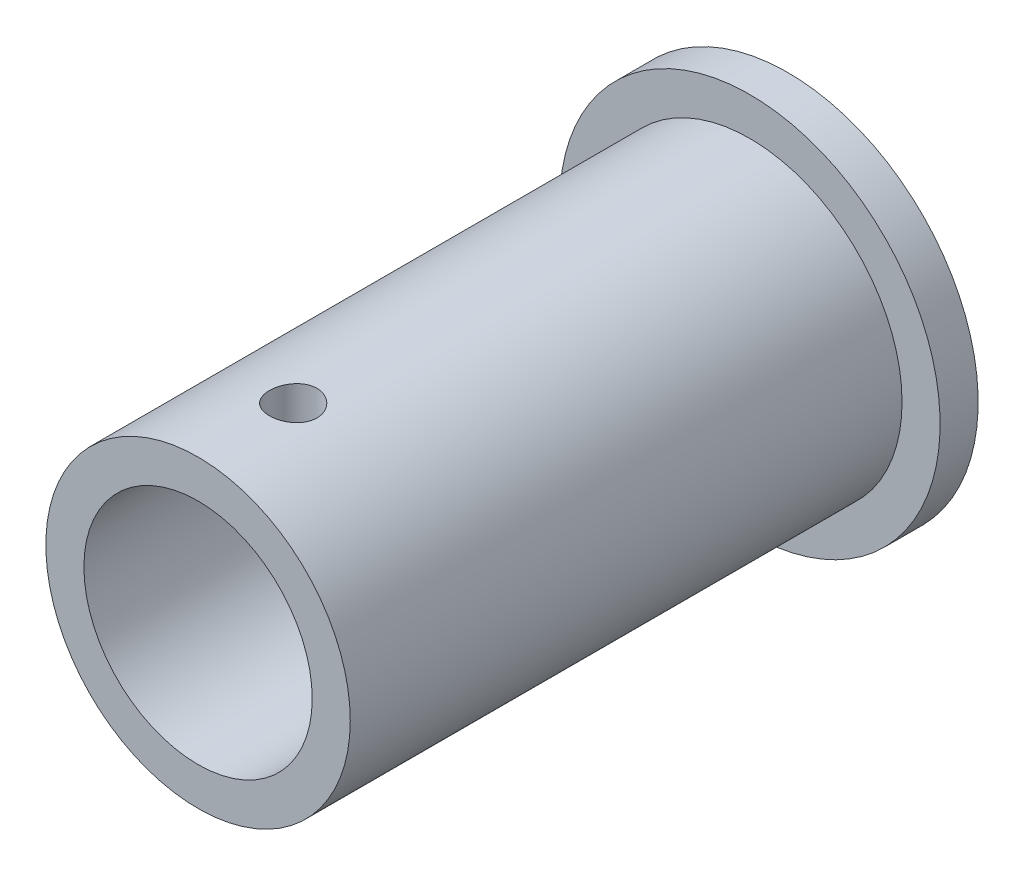
ISO-10303-21;
HEADER;
FILE_DESCRIPTION(('STEP AP214'),'2;1');
FILE_NAME('part.step','',(''),(''),'','','');
FILE_SCHEMA(('AUTOMOTIVE_DESIGN { 1 0 10303 214 1 1 1 1 }'));
ENDSEC;
DATA;
#1=APPLICATION_CONTEXT('core data for automotive mechanical design processes');
#2=APPLICATION_PROTOCOL_DEFINITION('international standard','automotive_design',2000,#1);
#3=PRODUCT_CONTEXT('',#1,'mechanical');
#4=PRODUCT('Part','Part','',(#3));
#5=PRODUCT_RELATED_PRODUCT_CATEGORY('part','',(#4));
#6=PRODUCT_DEFINITION_FORMATION('','',#4);
#7=PRODUCT_DEFINITION_CONTEXT('part definition',#1,'design');
#8=PRODUCT_DEFINITION('design','',#6,#7);
#9=PRODUCT_DEFINITION_SHAPE('','',#8);
#10=(LENGTH_UNIT() NAMED_UNIT(*) SI_UNIT(.MILLI.,.METRE.));
#11=(NAMED_UNIT(*) PLANE_ANGLE_UNIT() SI_UNIT($,.RADIAN.));
#12=(NAMED_UNIT(*) SI_UNIT($,.STERADIAN.) SOLID_ANGLE_UNIT());
#13=UNCERTAINTY_MEASURE_WITH_UNIT(LENGTH_MEASURE(1.E-05),#10,'distance_accuracy_value','');
#14=(GEOMETRIC_REPRESENTATION_CONTEXT(3) GLOBAL_UNCERTAINTY_ASSIGNED_CONTEXT((#13)) GLOBAL_UNIT_ASSIGNED_CONTEXT((#10,
#11,#12)) REPRESENTATION_CONTEXT('',''));
#15=CARTESIAN_POINT('',(0.,0.,0.));
#16=DIRECTION('',(0.,0.,1.));
#17=DIRECTION('',(1.,0.,0.));
#18=AXIS2_PLACEMENT_3D('',#15,#16,#17);
#19=CARTESIAN_POINT('',(0.,0.,-2.));
#20=DIRECTION('',(0.,0.,-1.));
#21=DIRECTION('',(-1.,0.,0.));
#22=AXIS2_PLACEMENT_3D('',#19,#20,#21);
#23=PLANE('',#22);
#24=CARTESIAN_POINT('',(0.,0.,-2.));
#25=DIRECTION('',(0.,0.,-1.));
#26=DIRECTION('',(-1.,0.,0.));
#27=AXIS2_PLACEMENT_3D('',#24,#25,#26);
#28=CIRCLE('',#27,10.);
#29=CARTESIAN_POINT('',(-10.,0.,-2.));
#30=VERTEX_POINT('',#29);
#31=EDGE_CURVE('E11',#30,#30,#28,.T.);
#32=ORIENTED_EDGE('',*,*,#31,.T.);
#33=EDGE_LOOP('',(#32));
#34=FACE_BOUND('',#33,.T.);
#35=CARTESIAN_POINT('',(0.,0.,-2.));
#36=DIRECTION('',(0.,0.,-1.));
#37=DIRECTION('',(-1.,0.,0.));
#38=AXIS2_PLACEMENT_3D('',#35,#36,#37);
#39=CIRCLE('',#38,6.);
#40=CARTESIAN_POINT('',(-6.,0.,-2.));
#41=VERTEX_POINT('',#40);
#42=EDGE_CURVE('E55',#41,#41,#39,.T.);
#43=ORIENTED_EDGE('',*,*,#42,.F.);
#44=EDGE_LOOP('',(#43));
#45=FACE_BOUND('',#44,.T.);
#46=ADVANCED_FACE('F44',(#34,#45),#23,.T.);
#47=CARTESIAN_POINT('',(0.,0.,0.));
#48=DIRECTION('',(0.,0.,-1.));
#49=DIRECTION('',(-1.,0.,0.));
#50=AXIS2_PLACEMENT_3D('',#47,#48,#49);
#51=PLANE('',#50);
#52=CARTESIAN_POINT('',(0.,0.,0.));
#53=DIRECTION('',(0.,0.,-1.));
#54=DIRECTION('',(-1.,0.,0.));
#55=AXIS2_PLACEMENT_3D('',#52,#53,#54);
#56=CIRCLE('',#55,10.);
#57=CARTESIAN_POINT('',(-10.,0.,0.));
#58=VERTEX_POINT('',#57);
#59=EDGE_CURVE('E48',#58,#58,#56,.T.);
#60=ORIENTED_EDGE('',*,*,#59,.F.);
#61=EDGE_LOOP('',(#60));
#62=FACE_BOUND('',#61,.T.);
#63=CARTESIAN_POINT('',(0.,0.,0.));
#64=DIRECTION('',(0.,0.,-1.));
#65=DIRECTION('',(-1.,0.,0.));
#66=AXIS2_PLACEMENT_3D('',#63,#64,#65);
#67=CIRCLE('',#66,6.);
#68=CARTESIAN_POINT('',(-6.,0.,0.));
#69=VERTEX_POINT('',#68);
#70=EDGE_CURVE('E57',#69,#69,#67,.T.);
#71=ORIENTED_EDGE('',*,*,#70,.T.);
#72=EDGE_LOOP('',(#71));
#73=FACE_BOUND('',#72,.T.);
#74=ADVANCED_FACE('F67',(#62,#73),#51,.F.);
#75=CARTESIAN_POINT('',(0.,0.,-2.));
#76=DIRECTION('',(0.,0.,1.));
#77=DIRECTION('',(1.,0.,0.));
#78=AXIS2_PLACEMENT_3D('',#75,#76,#77);
#79=CYLINDRICAL_SURFACE('',#78,10.);
#80=ORIENTED_EDGE('',*,*,#31,.F.);
#81=EDGE_LOOP('',(#80));
#82=FACE_BOUND('',#81,.T.);
#83=ORIENTED_EDGE('',*,*,#59,.T.);
#84=EDGE_LOOP('',(#83));
#85=FACE_BOUND('',#84,.T.);
#86=ADVANCED_FACE('F46',(#82,#85),#79,.T.);
#87=CARTESIAN_POINT('',(0.,0.,-2.));
#88=DIRECTION('',(0.,0.,1.));
#89=DIRECTION('',(1.,0.,0.));
#90=AXIS2_PLACEMENT_3D('',#87,#88,#89);
#91=CYLINDRICAL_SURFACE('',#90,6.);
#92=ORIENTED_EDGE('',*,*,#42,.T.);
#93=EDGE_LOOP('',(#92));
#94=FACE_BOUND('',#93,.T.);
#95=ORIENTED_EDGE('',*,*,#70,.F.);
#96=EDGE_LOOP('',(#95));
#97=FACE_BOUND('',#96,.T.);
#98=ADVANCED_FACE('F63',(#94,#97),#91,.F.);
#99=CLOSED_SHELL('',(#46,#74,#86,#98));
#100=MANIFOLD_SOLID_BREP('B2',#99);
#101=CARTESIAN_POINT('',(0.,0.,29.));
#102=DIRECTION('',(0.,0.,-1.));
#103=DIRECTION('',(-1.,0.,0.));
#104=AXIS2_PLACEMENT_3D('',#101,#102,#103);
#105=CYLINDRICAL_SURFACE('',#104,8.);
#106=CARTESIAN_POINT('',(0.,0.,29.));
#107=DIRECTION('',(0.,0.,1.));
#108=DIRECTION('',(1.,0.,0.));
#109=AXIS2_PLACEMENT_3D('',#106,#107,#108);
#110=CIRCLE('',#109,8.);
#111=CARTESIAN_POINT('',(8.,0.,29.));
#112=VERTEX_POINT('',#111);
#113=EDGE_CURVE('E43',#112,#112,#110,.T.);
#114=ORIENTED_EDGE('',*,*,#113,.F.);
#115=EDGE_LOOP('',(#114));
#116=FACE_BOUND('',#115,.T.);
#117=CARTESIAN_POINT('',(0.,0.,0.));
#118=DIRECTION('',(0.,0.,1.));
#119=DIRECTION('',(1.,0.,0.));
#120=AXIS2_PLACEMENT_3D('',#117,#118,#119);
#121=CIRCLE('',#120,8.);
#122=CARTESIAN_POINT('',(8.,0.,0.));
#123=VERTEX_POINT('',#122);
#124=EDGE_CURVE('E119',#123,#123,#121,.T.);
#125=ORIENTED_EDGE('',*,*,#124,.T.);
#126=EDGE_LOOP('',(#125));
#127=FACE_BOUND('',#126,.T.);
#128=CARTESIAN_POINT('',(0.,8.,22.75));
#129=CARTESIAN_POINT('',(-0.0697575486355165,7.99999885097242,22.7500028491358));
#130=CARTESIAN_POINT('',(-0.139554702432852,7.9990780624287,22.7558590568868));
#131=CARTESIAN_POINT('',(-0.277195657489051,7.99549349048796,22.7791218456384));
#132=CARTESIAN_POINT('',(-0.345037530661658,7.99282804422361,22.7965394462518));
#133=CARTESIAN_POINT('',(-0.476756269023701,7.98605348582888,22.8423898314033));
#134=CARTESIAN_POINT('',(-0.540636176144951,7.98194549781586,22.8708140406808));
#135=CARTESIAN_POINT('',(-0.662710625522299,7.97273897019077,22.9378492725708));
#136=CARTESIAN_POINT('',(-0.720905905184154,7.96764055931276,22.976458971518));
#137=CARTESIAN_POINT('',(-0.83045995582581,7.95697134207178,23.063116524177));
#138=CARTESIAN_POINT('',(-0.881763739571324,7.95139725696168,23.1112334974451));
#139=CARTESIAN_POINT('',(-0.975603844114118,7.94043038065143,23.2153909741344));
#140=CARTESIAN_POINT('',(-1.01813964327096,7.93503760025374,23.2714319486501));
#141=CARTESIAN_POINT('',(-1.09345272164442,7.92501214063722,23.3902191356719));
#142=CARTESIAN_POINT('',(-1.12617636778996,7.92038369893052,23.4529997411809));
#143=CARTESIAN_POINT('',(-1.18059340798533,7.91245600871182,23.5832507054289));
#144=CARTESIAN_POINT('',(-1.20228745505032,7.90915668151108,23.6507207862553));
#145=CARTESIAN_POINT('',(-1.23385779661084,7.90429317255518,23.7878554505719));
#146=CARTESIAN_POINT('',(-1.24382852743748,7.90271513266182,23.8574977929094));
#147=CARTESIAN_POINT('',(-1.25196184878811,7.90143085535887,23.9974835944463));
#148=CARTESIAN_POINT('',(-1.25012517430233,7.90172450144011,24.067827009733));
#149=CARTESIAN_POINT('',(-1.23477290404445,7.90413775227603,24.2065485159263));
#150=CARTESIAN_POINT('',(-1.22136281479847,7.90624086092473,24.2749386116766));
#151=CARTESIAN_POINT('',(-1.18340968916876,7.91201028172736,24.4084860031797));
#152=CARTESIAN_POINT('',(-1.15886631342066,7.91567664153206,24.4736432003203));
#153=CARTESIAN_POINT('',(-1.09923458474692,7.92417753427311,24.5991943563386));
#154=CARTESIAN_POINT('',(-1.06410186157775,7.92901696543622,24.6595668958865));
#155=CARTESIAN_POINT('',(-0.984320290733188,7.93931523075049,24.7735997678428));
#156=CARTESIAN_POINT('',(-0.939670766265085,7.94477410894106,24.8272596224437));
#157=CARTESIAN_POINT('',(-0.841545444111666,7.95576893124448,24.9269551233167));
#158=CARTESIAN_POINT('',(-0.787979002802697,7.96130506817796,24.9729015791347));
#159=CARTESIAN_POINT('',(-0.673848473689682,7.97177562673913,25.0551665728199));
#160=CARTESIAN_POINT('',(-0.613284350340662,7.97671004531012,25.0914850617784));
#161=CARTESIAN_POINT('',(-0.486797963528248,7.98542699513518,25.1534690367112));
#162=CARTESIAN_POINT('',(-0.420872093120232,7.98920874270967,25.1791272792665));
#163=CARTESIAN_POINT('',(-0.285574767348381,7.99518780000339,25.2189829837236));
#164=CARTESIAN_POINT('',(-0.216203565343601,7.99738522604488,25.2331812870332));
#165=CARTESIAN_POINT('',(-0.076754168381868,7.99993255863639,25.2495946382251));
#166=CARTESIAN_POINT('',(-0.0066907307543512,8.0003013589643,25.2519322394881));
#167=CARTESIAN_POINT('',(0.132827273205821,7.99920143245634,25.244883647332));
#168=CARTESIAN_POINT('',(0.202281859962578,7.99773276749822,25.2354978487054));
#169=CARTESIAN_POINT('',(0.338236723132853,7.99313461846611,25.2053708061599));
#170=CARTESIAN_POINT('',(0.404750631028022,7.99001392107693,25.1846896208661));
#171=CARTESIAN_POINT('',(0.533367033928314,7.98246037841779,25.1326224528006));
#172=CARTESIAN_POINT('',(0.595469306519704,7.97802746705036,25.1012359307787));
#173=CARTESIAN_POINT('',(0.714036101125203,7.96829486370472,25.0283640044367));
#174=CARTESIAN_POINT('',(0.770452561891861,7.9629886433171,24.9868012899548));
#175=CARTESIAN_POINT('',(0.87555348253903,7.95211940232218,24.8948639570461));
#176=CARTESIAN_POINT('',(0.924237452235089,7.94655636546338,24.8444887803976));
#177=CARTESIAN_POINT('',(1.01294040388345,7.93574013768325,24.7358094013914));
#178=CARTESIAN_POINT('',(1.05287699292063,7.93049020595401,24.6774375764388));
#179=CARTESIAN_POINT('',(1.1223778386332,7.92095346402914,24.5547419631693));
#180=CARTESIAN_POINT('',(1.15194239389052,7.91666662610998,24.4904183462553));
#181=CARTESIAN_POINT('',(1.19973385972497,7.90956535676178,24.3578851796429));
#182=CARTESIAN_POINT('',(1.21800327473956,7.9067454117448,24.2896912656172));
#183=CARTESIAN_POINT('',(1.24282061020268,7.90288285140397,24.151155428168));
#184=CARTESIAN_POINT('',(1.24936941542499,7.9018401019222,24.0808136672905));
#185=CARTESIAN_POINT('',(1.25053726345378,7.90165529022442,23.9408006420463));
#186=CARTESIAN_POINT('',(1.24528590274213,7.90249258021451,23.8711304515333));
#187=CARTESIAN_POINT('',(1.2232811162795,7.90592849470915,23.7336773514279));
#188=CARTESIAN_POINT('',(1.20652771543481,7.90852711539975,23.6658944377491));
#189=CARTESIAN_POINT('',(1.16204164945926,7.91518544427452,23.5341810866797));
#190=CARTESIAN_POINT('',(1.1343188086929,7.91924384476704,23.4702472608708));
#191=CARTESIAN_POINT('',(1.06869384273209,7.92836592023698,23.3479171931619));
#192=CARTESIAN_POINT('',(1.03079131410443,7.93342963505413,23.2895211708558));
#193=CARTESIAN_POINT('',(0.9454150406954,7.9440578404613,23.1792672279366));
#194=CARTESIAN_POINT('',(0.897845535473845,7.94962700580145,23.1274839016931));
#195=CARTESIAN_POINT('',(0.794687973191023,7.96060021820367,23.0325893818066));
#196=CARTESIAN_POINT('',(0.739098060392164,7.96600422670061,22.9894802007041));
#197=CARTESIAN_POINT('',(0.621083429421708,7.9760755122835,22.9129243884842));
#198=CARTESIAN_POINT('',(0.558619686071192,7.98073817215134,22.8795373136202));
#199=CARTESIAN_POINT('',(0.428925941178892,7.9887562991944,22.8237795019035));
#200=CARTESIAN_POINT('',(0.361700888290881,7.9921131007106,22.8013975137208));
#201=CARTESIAN_POINT('',(0.245157119955797,7.9963872293244,22.7732834894547));
#202=CARTESIAN_POINT('',(0.196552787825812,7.99773495813061,22.7645657546855));
#203=CARTESIAN_POINT('',(0.0986388989252913,7.99954174348811,22.7529230433105));
#204=CARTESIAN_POINT('',(0.0493293520845594,8.00000081253982,22.7499979852213));
#205=CARTESIAN_POINT('',(0.,8.,22.75));
#206=B_SPLINE_CURVE_WITH_KNOTS('',3,(#128,#129,#130,#131,#132,#133,#134,#135,#136,#137,#138,
#139,#140,#141,#142,#143,#144,#145,#146,#147,#148,#149,#150,#151,#152,#153,#154,#155,#156,#157,
#158,#159,#160,#161,#162,#163,#164,#165,#166,#167,#168,#169,#170,#171,#172,#173,#174,#175,#176,
#177,#178,#179,#180,#181,#182,#183,#184,#185,#186,#187,#188,#189,#190,#191,#192,#193,#194,#195,
#196,#197,#198,#199,#200,#201,#202,#203,#204,#205),.UNSPECIFIED.,.T.,.F.,(4,2,2,2,2,2,2,2,2,2,2,
2,2,2,2,2,2,2,2,2,2,2,2,2,2,2,2,2,2,2,2,2,2,2,2,2,2,2,4),(0.,0.209092370238746,
0.418384321264007,0.627513539720512,0.83661559396015,1.047297840761,1.25799261822711,
1.4698188930288,1.68163262504619,1.89172815567497,2.10181060835273,2.3099978801129,
2.51819149825525,2.72726988701174,2.93636314946034,3.14772866167183,3.35909524756913,
3.57060521877282,3.78209965914933,3.99140427002957,4.20070183264178,4.40889722378284,
4.61710310371016,4.82694270734836,5.03679560800708,5.24854740124796,5.46029309824491,
5.67123705197566,5.88216508114649,6.09078790799346,6.29941028309449,6.5078462348331,
6.71629044835674,6.92691006157771,7.1375784857115,7.34951152099922,7.56122742828141,
7.7090900817577,7.85695065529355),.UNSPECIFIED.);
#207=CARTESIAN_POINT('',(0.,8.,22.75));
#208=VERTEX_POINT('',#207);
#209=EDGE_CURVE('E131',#208,#208,#206,.T.);
#210=ORIENTED_EDGE('',*,*,#209,.F.);
#211=EDGE_LOOP('',(#210));
#212=FACE_BOUND('',#211,.T.);
#213=ADVANCED_FACE('F105',(#116,#127,#212),#105,.T.);
#214=CARTESIAN_POINT('',(0.,0.,29.));
#215=DIRECTION('',(0.,0.,-1.));
#216=DIRECTION('',(-1.,0.,0.));
#217=AXIS2_PLACEMENT_3D('',#214,#215,#216);
#218=CYLINDRICAL_SURFACE('',#217,6.);
#219=CARTESIAN_POINT('',(0.,0.,0.));
#220=DIRECTION('',(0.,0.,1.));
#221=DIRECTION('',(1.,0.,0.));
#222=AXIS2_PLACEMENT_3D('',#219,#220,#221);
#223=CIRCLE('',#222,6.);
#224=CARTESIAN_POINT('',(6.,0.,0.));
#225=VERTEX_POINT('',#224);
#226=EDGE_CURVE('E127',#225,#225,#223,.T.);
#227=ORIENTED_EDGE('',*,*,#226,.F.);
#228=EDGE_LOOP('',(#227));
#229=FACE_BOUND('',#228,.T.);
#230=CARTESIAN_POINT('',(0.,0.,29.));
#231=DIRECTION('',(0.,0.,1.));
#232=DIRECTION('',(1.,0.,0.));
#233=AXIS2_PLACEMENT_3D('',#230,#231,#232);
#234=CIRCLE('',#233,6.);
#235=CARTESIAN_POINT('',(6.,0.,29.));
#236=VERTEX_POINT('',#235);
#237=EDGE_CURVE('E125',#236,#236,#234,.T.);
#238=ORIENTED_EDGE('',*,*,#237,.T.);
#239=EDGE_LOOP('',(#238));
#240=FACE_BOUND('',#239,.T.);
#241=CARTESIAN_POINT('',(0.,6.,22.75));
#242=CARTESIAN_POINT('',(-0.0694090417016606,5.99999871526651,22.7500024774692));
#243=CARTESIAN_POINT('',(-0.138848789520875,5.99878328775043,22.7558006657188));
#244=CARTESIAN_POINT('',(-0.275761316266993,5.9940520099068,22.7788193495328));
#245=CARTESIAN_POINT('',(-0.343232560128313,5.99053441189248,22.7960485230369));
#246=CARTESIAN_POINT('',(-0.474209132291342,5.98159109196202,22.8413704549218));
#247=CARTESIAN_POINT('',(-0.537718336709184,5.97616727052645,22.8694523959989));
#248=CARTESIAN_POINT('',(-0.659120328605958,5.96399927809859,22.9356496088562));
#249=CARTESIAN_POINT('',(-0.717013367534327,5.95725516625975,22.9737644311558));
#250=CARTESIAN_POINT('',(-0.826390324308837,5.9430770002465,23.0595363401906));
#251=CARTESIAN_POINT('',(-0.877780244162686,5.93563505848531,23.1073120012351));
#252=CARTESIAN_POINT('',(-0.971877776769394,5.92095657692448,23.2107946591951));
#253=CARTESIAN_POINT('',(-1.01458467096099,5.91372005416683,23.2665023118723));
#254=CARTESIAN_POINT('',(-1.09051031677217,5.90019442595308,23.3849519687662));
#255=CARTESIAN_POINT('',(-1.12363054680651,5.89391545174828,23.4477583845027));
#256=CARTESIAN_POINT('',(-1.17881119348064,5.8831284065002,23.5781974517728));
#257=CARTESIAN_POINT('',(-1.20087280167641,5.87862014467568,23.6458295824425));
#258=CARTESIAN_POINT('',(-1.23300240133737,5.87196500986123,23.7829852374156));
#259=CARTESIAN_POINT('',(-1.24323597696799,5.86978556855865,23.8524683593348));
#260=CARTESIAN_POINT('',(-1.25193357655615,5.86793690716491,23.9921968428626));
#261=CARTESIAN_POINT('',(-1.25039890894687,5.86826740800981,24.0624421188653));
#262=CARTESIAN_POINT('',(-1.23573719037197,5.87137174319175,24.2004810279752));
#263=CARTESIAN_POINT('',(-1.2228010523272,5.87410533679901,24.2682959796612));
#264=CARTESIAN_POINT('',(-1.18600543529945,5.88164437615942,24.4007715096449));
#265=CARTESIAN_POINT('',(-1.16214539481382,5.88644992841317,24.4654319256063));
#266=CARTESIAN_POINT('',(-1.10400003213928,5.89763191464102,24.590307228416));
#267=CARTESIAN_POINT('',(-1.06964002534237,5.90401953785586,24.6504862965271));
#268=CARTESIAN_POINT('',(-0.991522699274819,5.91763890010721,24.7642957442682));
#269=CARTESIAN_POINT('',(-0.94776421226259,5.92487074398537,24.817925308836));
#270=CARTESIAN_POINT('',(-0.851074921546786,5.93953730929909,24.9182139610804));
#271=CARTESIAN_POINT('',(-0.797981433412084,5.94697323199473,24.964716168897));
#272=CARTESIAN_POINT('',(-0.684667288611799,5.96108088143001,25.048180442229));
#273=CARTESIAN_POINT('',(-0.624446525025767,5.96775259670236,25.0851423645984));
#274=CARTESIAN_POINT('',(-0.49840554123548,5.97959870942815,25.148510081536));
#275=CARTESIAN_POINT('',(-0.432575461926501,5.98477039710258,25.1748968045671));
#276=CARTESIAN_POINT('',(-0.297284620972155,5.99301338211281,25.2161917048355));
#277=CARTESIAN_POINT('',(-0.22782433859509,5.99608495596053,25.2311013932314));
#278=CARTESIAN_POINT('',(-0.088591865700835,5.99974275215456,25.2487942520679));
#279=CARTESIAN_POINT('',(-0.0188480555261786,6.00037293537579,25.2517919414943));
#280=CARTESIAN_POINT('',(0.120143798757714,5.99919952252774,25.2461550500309));
#281=CARTESIAN_POINT('',(0.189391872962257,5.99739607548153,25.2375211813984));
#282=CARTESIAN_POINT('',(0.324726367119813,5.99158564979184,25.2090443465305));
#283=CARTESIAN_POINT('',(0.390837192894206,5.98760052868077,25.1893125146165));
#284=CARTESIAN_POINT('',(0.518811446661332,5.97787227242395,25.1393221395786));
#285=CARTESIAN_POINT('',(0.580674536336775,5.97212899744579,25.109062759134));
#286=CARTESIAN_POINT('',(0.699294306943494,5.95941241490714,25.0384196217624));
#287=CARTESIAN_POINT('',(0.755973219469834,5.9524239381233,24.9979080704309));
#288=CARTESIAN_POINT('',(0.86180544588652,5.93802568299709,24.9080804369237));
#289=CARTESIAN_POINT('',(0.910957877913286,5.93061585542511,24.8587633244811));
#290=CARTESIAN_POINT('',(1.0011786486518,5.91606024531377,24.7517444230003));
#291=CARTESIAN_POINT('',(1.04209914600204,5.90892089307501,24.6939169680447));
#292=CARTESIAN_POINT('',(1.11364719079243,5.89585601015805,24.5720837157862));
#293=CARTESIAN_POINT('',(1.14427516677864,5.88993042894651,24.5080781758609));
#294=CARTESIAN_POINT('',(1.19417246443922,5.88001700708041,24.3760388037018));
#295=CARTESIAN_POINT('',(1.21350309828032,5.87601872784687,24.3080289628342));
#296=CARTESIAN_POINT('',(1.24044038523407,5.87039184709697,24.1696334495077));
#297=CARTESIAN_POINT('',(1.24804871544441,5.86876290660367,24.0992481183806));
#298=CARTESIAN_POINT('',(1.25125926487611,5.86807907308506,23.9595865990004));
#299=CARTESIAN_POINT('',(1.24709542622726,5.86897402321502,23.8903159297779));
#300=CARTESIAN_POINT('',(1.22739905314032,5.87312447254927,23.7534859910798));
#301=CARTESIAN_POINT('',(1.21186662782266,5.87637994909626,23.6859267051839));
#302=CARTESIAN_POINT('',(1.16998217768585,5.88486132447716,23.5546022281093));
#303=CARTESIAN_POINT('',(1.14366117568421,5.8900815700793,23.4908267535131));
#304=CARTESIAN_POINT('',(1.08097457299757,5.90190705738738,23.3685612239733));
#305=CARTESIAN_POINT('',(1.0446080398303,5.9085124276546,23.3100716603669));
#306=CARTESIAN_POINT('',(0.962073695342413,5.92251579551146,23.1988783729206));
#307=CARTESIAN_POINT('',(0.915737890418228,5.92992613868404,23.146300875435));
#308=CARTESIAN_POINT('',(0.814924438115336,5.94461839583213,23.0495905067736));
#309=CARTESIAN_POINT('',(0.76044491883297,5.9519002798488,23.0054595824485));
#310=CARTESIAN_POINT('',(0.644134427507706,5.96561444547638,22.9264114268159));
#311=CARTESIAN_POINT('',(0.582225921521351,5.97203596073244,22.8916063201137));
#312=CARTESIAN_POINT('',(0.453319843998456,5.98319908494092,22.83294977157));
#313=CARTESIAN_POINT('',(0.386326781907246,5.98794216182101,22.8090887528181));
#314=CARTESIAN_POINT('',(0.266015292900107,5.99432499781444,22.7774597217116));
#315=CARTESIAN_POINT('',(0.213367593727931,5.99644035661395,22.7671812367911));
#316=CARTESIAN_POINT('',(0.107152674176538,5.99927832789758,22.7534505457227));
#317=CARTESIAN_POINT('',(0.0535854878488722,6.00000099184586,22.7499980873328));
#318=CARTESIAN_POINT('',(0.,6.,22.75));
#319=B_SPLINE_CURVE_WITH_KNOTS('',3,(#241,#242,#243,#244,#245,#246,#247,#248,#249,#250,#251,
#252,#253,#254,#255,#256,#257,#258,#259,#260,#261,#262,#263,#264,#265,#266,#267,#268,#269,#270,
#271,#272,#273,#274,#275,#276,#277,#278,#279,#280,#281,#282,#283,#284,#285,#286,#287,#288,#289,
#290,#291,#292,#293,#294,#295,#296,#297,#298,#299,#300,#301,#302,#303,#304,#305,#306,#307,#308,
#309,#310,#311,#312,#313,#314,#315,#316,#317,#318),.UNSPECIFIED.,.T.,.F.,(4,2,2,2,2,2,2,2,2,2,2,
2,2,2,2,2,2,2,2,2,2,2,2,2,2,2,2,2,2,2,2,2,2,2,2,2,2,2,4),(0.,0.208031045103183,
0.416220199906225,0.624202378825441,0.83217524157299,1.04287526388123,1.25359271551786,
1.46640449178549,1.6791933328549,1.88896575169855,2.09871484767164,2.3050171212906,
2.5113300003028,2.71914592416749,2.92698768368034,3.13889526355466,3.35080602278218,
3.56309724499663,3.77536051045772,3.98378339407676,4.19219351552278,4.39855286632622,
4.60492863390934,4.81401583995737,5.02312752564574,5.23571263829337,5.4482888985131,
5.65970050095025,5.87108185414185,6.07829223291039,6.28550062281362,6.49211731393256,
6.69875319081481,6.9091902483031,7.1196757511737,7.33258864398257,7.54531486464974,
7.70592588477281,7.86653096973392),.UNSPECIFIED.);
#320=CARTESIAN_POINT('',(0.,6.,22.75));
#321=VERTEX_POINT('',#320);
#322=EDGE_CURVE('E109',#321,#321,#319,.T.);
#323=ORIENTED_EDGE('',*,*,#322,.T.);
#324=EDGE_LOOP('',(#323));
#325=FACE_BOUND('',#324,.T.);
#326=ADVANCED_FACE('F145',(#229,#240,#325),#218,.F.);
#327=CARTESIAN_POINT('',(0.,0.,29.));
#328=DIRECTION('',(0.,0.,1.));
#329=DIRECTION('',(1.,0.,0.));
#330=AXIS2_PLACEMENT_3D('',#327,#328,#329);
#331=PLANE('',#330);
#332=ORIENTED_EDGE('',*,*,#113,.T.);
#333=EDGE_LOOP('',(#332));
#334=FACE_BOUND('',#333,.T.);
#335=ORIENTED_EDGE('',*,*,#237,.F.);
#336=EDGE_LOOP('',(#335));
#337=FACE_BOUND('',#336,.T.);
#338=ADVANCED_FACE('F150',(#334,#337),#331,.T.);
#339=CARTESIAN_POINT('',(0.,0.,0.));
#340=DIRECTION('',(0.,0.,1.));
#341=DIRECTION('',(1.,0.,0.));
#342=AXIS2_PLACEMENT_3D('',#339,#340,#341);
#343=PLANE('',#342);
#344=ORIENTED_EDGE('',*,*,#124,.F.);
#345=EDGE_LOOP('',(#344));
#346=FACE_BOUND('',#345,.T.);
#347=ORIENTED_EDGE('',*,*,#226,.T.);
#348=EDGE_LOOP('',(#347));
#349=FACE_BOUND('',#348,.T.);
#350=ADVANCED_FACE('F143',(#346,#349),#343,.F.);
#351=CARTESIAN_POINT('',(0.,10.,24.));
#352=DIRECTION('',(0.,-1.,0.));
#353=DIRECTION('',(0.,0.,-1.));
#354=AXIS2_PLACEMENT_3D('',#351,#352,#353);
#355=CYLINDRICAL_SURFACE('',#354,1.25);
#356=ORIENTED_EDGE('',*,*,#322,.F.);
#357=EDGE_LOOP('',(#356));
#358=FACE_BOUND('',#357,.T.);
#359=ORIENTED_EDGE('',*,*,#209,.T.);
#360=EDGE_LOOP('',(#359));
#361=FACE_BOUND('',#360,.T.);
#362=ADVANCED_FACE('F140',(#358,#361),#355,.F.);
#363=CLOSED_SHELL('',(#213,#326,#338,#350,#362));
#364=MANIFOLD_SOLID_BREP('B6',#363);
#365=ADVANCED_BREP_SHAPE_REPRESENTATION('',(#18,#100,#364),#14);
#366=SHAPE_DEFINITION_REPRESENTATION(#9,#365);
ENDSEC;
END-ISO-10303-21;
